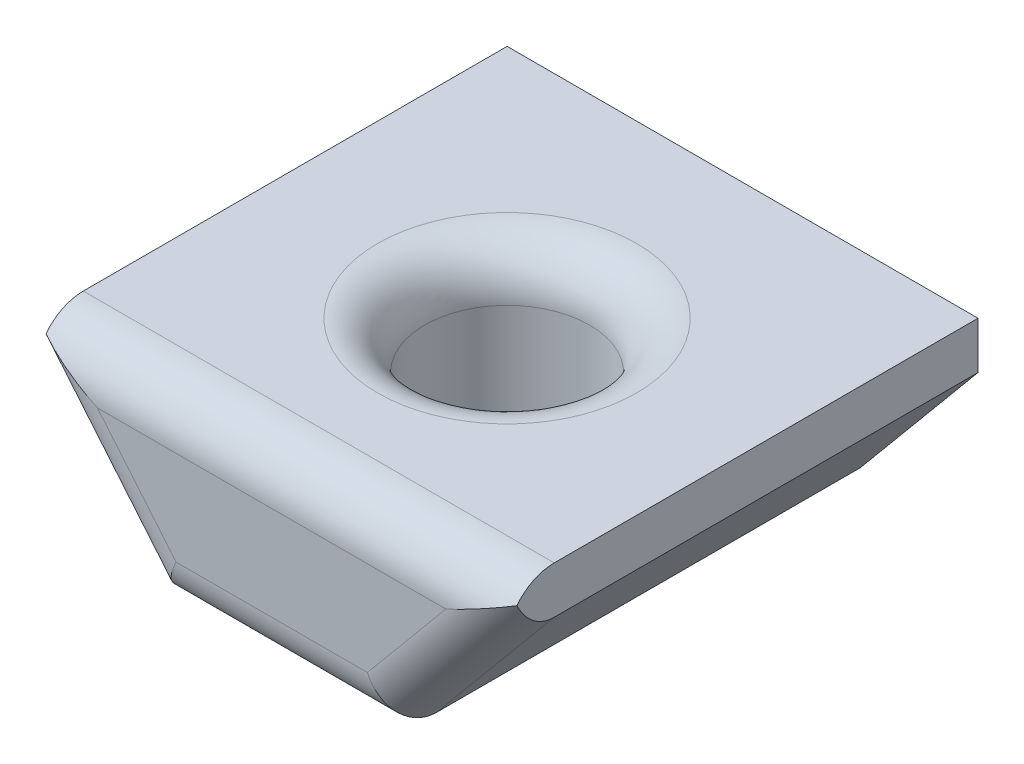
ISO-10303-21;
HEADER;
FILE_DESCRIPTION(('STEP AP214'),'2;1');
FILE_NAME('part.step','',(''),(''),'','','');
FILE_SCHEMA(('AUTOMOTIVE_DESIGN { 1 0 10303 214 1 1 1 1 }'));
ENDSEC;
DATA;
#1=APPLICATION_CONTEXT('core data for automotive mechanical design processes');
#2=APPLICATION_PROTOCOL_DEFINITION('international standard','automotive_design',2000,#1);
#3=PRODUCT_CONTEXT('',#1,'mechanical');
#4=PRODUCT('Part','Part','',(#3));
#5=PRODUCT_RELATED_PRODUCT_CATEGORY('part','',(#4));
#6=PRODUCT_DEFINITION_FORMATION('','',#4);
#7=PRODUCT_DEFINITION_CONTEXT('part definition',#1,'design');
#8=PRODUCT_DEFINITION('design','',#6,#7);
#9=PRODUCT_DEFINITION_SHAPE('','',#8);
#10=(LENGTH_UNIT() NAMED_UNIT(*) SI_UNIT(.MILLI.,.METRE.));
#11=(NAMED_UNIT(*) PLANE_ANGLE_UNIT() SI_UNIT($,.RADIAN.));
#12=(NAMED_UNIT(*) SI_UNIT($,.STERADIAN.) SOLID_ANGLE_UNIT());
#13=UNCERTAINTY_MEASURE_WITH_UNIT(LENGTH_MEASURE(1.E-05),#10,'distance_accuracy_value','');
#14=(GEOMETRIC_REPRESENTATION_CONTEXT(3) GLOBAL_UNCERTAINTY_ASSIGNED_CONTEXT((#13)) GLOBAL_UNIT_ASSIGNED_CONTEXT((#10,
#11,#12)) REPRESENTATION_CONTEXT('',''));
#15=CARTESIAN_POINT('',(0.,0.,0.));
#16=DIRECTION('',(0.,0.,1.));
#17=DIRECTION('',(1.,0.,0.));
#18=AXIS2_PLACEMENT_3D('',#15,#16,#17);
#19=CARTESIAN_POINT('',(2.5,0.,10.));
#20=DIRECTION('',(-0.768221279597376,0.64018439966448,0.));
#21=DIRECTION('',(-0.64018439966448,-0.768221279597376,0.));
#22=AXIS2_PLACEMENT_3D('',#19,#20,#21);
#23=PLANE('',#22);
#24=DIRECTION('',(0.,0.,-1.));
#25=VECTOR('',#24,1.);
#26=CARTESIAN_POINT('',(5.,3.,10.));
#27=LINE('',#26,#25);
#28=CARTESIAN_POINT('',(5.,3.,9.));
#29=VERTEX_POINT('',#28);
#30=CARTESIAN_POINT('',(5.,3.,0.));
#31=VERTEX_POINT('',#30);
#32=EDGE_CURVE('E112',#29,#31,#27,.T.);
#33=ORIENTED_EDGE('',*,*,#32,.F.);
#34=DIRECTION('',(0.64018439966448,0.768221279597376,0.));
#35=VECTOR('',#34,1.);
#36=CARTESIAN_POINT('',(2.5,0.,9.));
#37=LINE('',#36,#35);
#38=CARTESIAN_POINT('',(2.5,0.,9.));
#39=VERTEX_POINT('',#38);
#40=EDGE_CURVE('E194',#29,#39,#37,.F.);
#41=ORIENTED_EDGE('',*,*,#40,.T.);
#42=DIRECTION('',(0.,0.,-1.));
#43=VECTOR('',#42,1.);
#44=CARTESIAN_POINT('',(2.5,0.,10.));
#45=LINE('',#44,#43);
#46=CARTESIAN_POINT('',(2.5,0.,0.));
#47=VERTEX_POINT('',#46);
#48=EDGE_CURVE('E138',#39,#47,#45,.T.);
#49=ORIENTED_EDGE('',*,*,#48,.T.);
#50=DIRECTION('',(0.64018439966448,0.768221279597376,0.));
#51=VECTOR('',#50,1.);
#52=CARTESIAN_POINT('',(2.5,0.,0.));
#53=LINE('',#52,#51);
#54=EDGE_CURVE('E131',#47,#31,#53,.T.);
#55=ORIENTED_EDGE('',*,*,#54,.T.);
#56=EDGE_LOOP('',(#33,#41,#49,#55));
#57=FACE_BOUND('',#56,.T.);
#58=ADVANCED_FACE('F39',(#57),#23,.F.);
#59=CARTESIAN_POINT('',(5.,3.,10.));
#60=DIRECTION('',(-1.,0.,0.));
#61=DIRECTION('',(0.,-1.,0.));
#62=AXIS2_PLACEMENT_3D('',#59,#60,#61);
#63=PLANE('',#62);
#64=CARTESIAN_POINT('',(5.,3.,9.));
#65=DIRECTION('',(-1.,0.,0.));
#66=DIRECTION('',(0.,-1.,0.));
#67=AXIS2_PLACEMENT_3D('',#64,#65,#66);
#68=CIRCLE('',#67,1.);
#69=CARTESIAN_POINT('',(5.,4.,9.));
#70=VERTEX_POINT('',#69);
#71=CARTESIAN_POINT('',(5.,3.60968754501296,9.79264184689938));
#72=VERTEX_POINT('',#71);
#73=EDGE_CURVE('E189',#70,#72,#68,.F.);
#74=ORIENTED_EDGE('',*,*,#73,.T.);
#75=CARTESIAN_POINT('',(5.,4.56204993518133,9.));
#76=DIRECTION('',(-1.,0.,0.));
#77=DIRECTION('',(0.,-1.,0.));
#78=AXIS2_PLACEMENT_3D('',#75,#76,#77);
#79=ELLIPSE('',#78,1.56204993518133,1.);
#80=EDGE_CURVE('E119',#72,#29,#79,.F.);
#81=ORIENTED_EDGE('',*,*,#80,.T.);
#82=ORIENTED_EDGE('',*,*,#32,.T.);
#83=DIRECTION('',(0.,1.,0.));
#84=VECTOR('',#83,1.);
#85=CARTESIAN_POINT('',(5.,3.,0.));
#86=LINE('',#85,#84);
#87=CARTESIAN_POINT('',(5.,4.,0.));
#88=VERTEX_POINT('',#87);
#89=EDGE_CURVE('E116',#31,#88,#86,.T.);
#90=ORIENTED_EDGE('',*,*,#89,.T.);
#91=DIRECTION('',(0.,0.,-1.));
#92=VECTOR('',#91,1.);
#93=CARTESIAN_POINT('',(5.,4.,10.));
#94=LINE('',#93,#92);
#95=EDGE_CURVE('E125',#70,#88,#94,.T.);
#96=ORIENTED_EDGE('',*,*,#95,.F.);
#97=EDGE_LOOP('',(#74,#81,#82,#90,#96));
#98=FACE_BOUND('',#97,.T.);
#99=ADVANCED_FACE('F114',(#98),#63,.F.);
#100=CARTESIAN_POINT('',(5.,4.,10.));
#101=DIRECTION('',(0.,-1.,0.));
#102=DIRECTION('',(0.,0.,-1.));
#103=AXIS2_PLACEMENT_3D('',#100,#101,#102);
#104=PLANE('',#103);
#105=CARTESIAN_POINT('',(0.,4.,5.));
#106=DIRECTION('',(0.,-1.,0.));
#107=DIRECTION('',(0.,0.,-1.));
#108=AXIS2_PLACEMENT_3D('',#105,#106,#107);
#109=CIRCLE('',#108,2.75);
#110=CARTESIAN_POINT('',(0.,4.,2.25));
#111=VERTEX_POINT('',#110);
#112=EDGE_CURVE('E204',#111,#111,#109,.T.);
#113=ORIENTED_EDGE('',*,*,#112,.T.);
#114=EDGE_LOOP('',(#113));
#115=FACE_BOUND('',#114,.T.);
#116=DIRECTION('',(0.,0.,-1.));
#117=VECTOR('',#116,1.);
#118=CARTESIAN_POINT('',(-5.,4.,10.));
#119=LINE('',#118,#117);
#120=CARTESIAN_POINT('',(-5.,4.,9.));
#121=VERTEX_POINT('',#120);
#122=CARTESIAN_POINT('',(-5.,4.,0.));
#123=VERTEX_POINT('',#122);
#124=EDGE_CURVE('E168',#121,#123,#119,.T.);
#125=ORIENTED_EDGE('',*,*,#124,.F.);
#126=DIRECTION('',(-1.,0.,0.));
#127=VECTOR('',#126,1.);
#128=CARTESIAN_POINT('',(5.,4.,9.));
#129=LINE('',#128,#127);
#130=EDGE_CURVE('E49',#121,#70,#129,.F.);
#131=ORIENTED_EDGE('',*,*,#130,.T.);
#132=ORIENTED_EDGE('',*,*,#95,.T.);
#133=DIRECTION('',(-1.,0.,0.));
#134=VECTOR('',#133,1.);
#135=CARTESIAN_POINT('',(5.,4.,0.));
#136=LINE('',#135,#134);
#137=EDGE_CURVE('E134',#88,#123,#136,.T.);
#138=ORIENTED_EDGE('',*,*,#137,.T.);
#139=EDGE_LOOP('',(#125,#131,#132,#138));
#140=FACE_BOUND('',#139,.T.);
#141=ADVANCED_FACE('F235',(#115,#140),#104,.F.);
#142=CARTESIAN_POINT('',(-5.,3.,10.));
#143=DIRECTION('',(1.,0.,0.));
#144=DIRECTION('',(0.,1.,0.));
#145=AXIS2_PLACEMENT_3D('',#142,#143,#144);
#146=PLANE('',#145);
#147=DIRECTION('',(0.,0.,-1.));
#148=VECTOR('',#147,1.);
#149=CARTESIAN_POINT('',(-5.,3.,10.));
#150=LINE('',#149,#148);
#151=CARTESIAN_POINT('',(-5.,3.,9.));
#152=VERTEX_POINT('',#151);
#153=CARTESIAN_POINT('',(-5.,3.,0.));
#154=VERTEX_POINT('',#153);
#155=EDGE_CURVE('E165',#152,#154,#150,.T.);
#156=ORIENTED_EDGE('',*,*,#155,.F.);
#157=CARTESIAN_POINT('',(-5.,4.56204993518133,9.));
#158=DIRECTION('',(1.,0.,0.));
#159=DIRECTION('',(0.,1.,0.));
#160=AXIS2_PLACEMENT_3D('',#157,#158,#159);
#161=ELLIPSE('',#160,1.56204993518133,1.);
#162=CARTESIAN_POINT('',(-5.,3.60968754501296,9.79264184689938));
#163=VERTEX_POINT('',#162);
#164=EDGE_CURVE('E57',#152,#163,#161,.F.);
#165=ORIENTED_EDGE('',*,*,#164,.T.);
#166=CARTESIAN_POINT('',(-5.,3.,9.));
#167=DIRECTION('',(1.,0.,0.));
#168=DIRECTION('',(0.,1.,0.));
#169=AXIS2_PLACEMENT_3D('',#166,#167,#168);
#170=CIRCLE('',#169,1.);
#171=EDGE_CURVE('E61',#163,#121,#170,.F.);
#172=ORIENTED_EDGE('',*,*,#171,.T.);
#173=ORIENTED_EDGE('',*,*,#124,.T.);
#174=DIRECTION('',(0.,-1.,0.));
#175=VECTOR('',#174,1.);
#176=CARTESIAN_POINT('',(-5.,3.,0.));
#177=LINE('',#176,#175);
#178=EDGE_CURVE('E149',#123,#154,#177,.T.);
#179=ORIENTED_EDGE('',*,*,#178,.T.);
#180=EDGE_LOOP('',(#156,#165,#172,#173,#179));
#181=FACE_BOUND('',#180,.T.);
#182=ADVANCED_FACE('F247',(#181),#146,.F.);
#183=CARTESIAN_POINT('',(-2.5,0.,10.));
#184=DIRECTION('',(0.768221279597376,0.64018439966448,0.));
#185=DIRECTION('',(-0.64018439966448,0.768221279597376,0.));
#186=AXIS2_PLACEMENT_3D('',#183,#184,#185);
#187=PLANE('',#186);
#188=DIRECTION('',(0.,0.,-1.));
#189=VECTOR('',#188,1.);
#190=CARTESIAN_POINT('',(-2.5,0.,10.));
#191=LINE('',#190,#189);
#192=CARTESIAN_POINT('',(-2.5,0.,9.));
#193=VERTEX_POINT('',#192);
#194=CARTESIAN_POINT('',(-2.5,0.,0.));
#195=VERTEX_POINT('',#194);
#196=EDGE_CURVE('E162',#193,#195,#191,.T.);
#197=ORIENTED_EDGE('',*,*,#196,.F.);
#198=DIRECTION('',(0.64018439966448,-0.768221279597376,0.));
#199=VECTOR('',#198,1.);
#200=CARTESIAN_POINT('',(-5.,3.,9.));
#201=LINE('',#200,#199);
#202=EDGE_CURVE('E197',#193,#152,#201,.F.);
#203=ORIENTED_EDGE('',*,*,#202,.T.);
#204=ORIENTED_EDGE('',*,*,#155,.T.);
#205=DIRECTION('',(0.64018439966448,-0.768221279597376,0.));
#206=VECTOR('',#205,1.);
#207=CARTESIAN_POINT('',(-2.5,0.,0.));
#208=LINE('',#207,#206);
#209=EDGE_CURVE('E153',#154,#195,#208,.T.);
#210=ORIENTED_EDGE('',*,*,#209,.T.);
#211=EDGE_LOOP('',(#197,#203,#204,#210));
#212=FACE_BOUND('',#211,.T.);
#213=ADVANCED_FACE('F246',(#212),#187,.F.);
#214=CARTESIAN_POINT('',(-2.5,0.,10.));
#215=DIRECTION('',(0.,1.,0.));
#216=DIRECTION('',(0.,0.,1.));
#217=AXIS2_PLACEMENT_3D('',#214,#215,#216);
#218=PLANE('',#217);
#219=CARTESIAN_POINT('',(0.,0.,5.));
#220=DIRECTION('',(0.,1.,0.));
#221=DIRECTION('',(0.,0.,1.));
#222=AXIS2_PLACEMENT_3D('',#219,#220,#221);
#223=CIRCLE('',#222,1.75);
#224=CARTESIAN_POINT('',(0.,0.,6.75));
#225=VERTEX_POINT('',#224);
#226=EDGE_CURVE('E141',#225,#225,#223,.T.);
#227=ORIENTED_EDGE('',*,*,#226,.T.);
#228=EDGE_LOOP('',(#227));
#229=FACE_BOUND('',#228,.T.);
#230=ORIENTED_EDGE('',*,*,#48,.F.);
#231=DIRECTION('',(1.,0.,0.));
#232=VECTOR('',#231,1.);
#233=CARTESIAN_POINT('',(-2.5,0.,9.));
#234=LINE('',#233,#232);
#235=EDGE_CURVE('E185',#39,#193,#234,.F.);
#236=ORIENTED_EDGE('',*,*,#235,.T.);
#237=ORIENTED_EDGE('',*,*,#196,.T.);
#238=DIRECTION('',(1.,0.,0.));
#239=VECTOR('',#238,1.);
#240=CARTESIAN_POINT('',(-2.5,0.,0.));
#241=LINE('',#240,#239);
#242=EDGE_CURVE('E157',#195,#47,#241,.T.);
#243=ORIENTED_EDGE('',*,*,#242,.T.);
#244=EDGE_LOOP('',(#230,#236,#237,#243));
#245=FACE_BOUND('',#244,.T.);
#246=ADVANCED_FACE('F240',(#229,#245),#218,.F.);
#247=CARTESIAN_POINT('',(0.,0.,10.));
#248=DIRECTION('',(0.,0.,1.));
#249=DIRECTION('',(1.,0.,0.));
#250=AXIS2_PLACEMENT_3D('',#247,#248,#249);
#251=PLANE('',#250);
#252=DIRECTION('',(0.64018439966448,-0.768221279597376,0.));
#253=VECTOR('',#252,1.);
#254=CARTESIAN_POINT('',(-1.73177872040262,0.64018439966448,10.));
#255=LINE('',#254,#253);
#256=CARTESIAN_POINT('',(-3.69829172068223,3.,10.));
#257=VERTEX_POINT('',#256);
#258=CARTESIAN_POINT('',(-2.03162505401556,1.,10.));
#259=VERTEX_POINT('',#258);
#260=EDGE_CURVE('E175',#257,#259,#255,.T.);
#261=ORIENTED_EDGE('',*,*,#260,.T.);
#262=DIRECTION('',(1.,0.,0.));
#263=VECTOR('',#262,1.);
#264=CARTESIAN_POINT('',(2.5,1.,10.));
#265=LINE('',#264,#263);
#266=CARTESIAN_POINT('',(2.03162505401556,1.,10.));
#267=VERTEX_POINT('',#266);
#268=EDGE_CURVE('E181',#259,#267,#265,.T.);
#269=ORIENTED_EDGE('',*,*,#268,.T.);
#270=DIRECTION('',(0.64018439966448,0.768221279597376,0.));
#271=VECTOR('',#270,1.);
#272=CARTESIAN_POINT('',(4.23177872040262,3.64018439966448,10.));
#273=LINE('',#272,#271);
#274=CARTESIAN_POINT('',(3.69829172068222,3.,10.));
#275=VERTEX_POINT('',#274);
#276=EDGE_CURVE('E178',#267,#275,#273,.T.);
#277=ORIENTED_EDGE('',*,*,#276,.T.);
#278=DIRECTION('',(-1.,0.,0.));
#279=VECTOR('',#278,1.);
#280=CARTESIAN_POINT('',(-5.,3.,10.));
#281=LINE('',#280,#279);
#282=EDGE_CURVE('E124',#275,#257,#281,.T.);
#283=ORIENTED_EDGE('',*,*,#282,.T.);
#284=EDGE_LOOP('',(#261,#269,#277,#283));
#285=FACE_BOUND('',#284,.T.);
#286=ADVANCED_FACE('F280',(#285),#251,.T.);
#287=CARTESIAN_POINT('',(0.,0.,0.));
#288=DIRECTION('',(0.,0.,1.));
#289=DIRECTION('',(1.,0.,0.));
#290=AXIS2_PLACEMENT_3D('',#287,#288,#289);
#291=PLANE('',#290);
#292=ORIENTED_EDGE('',*,*,#54,.F.);
#293=ORIENTED_EDGE('',*,*,#242,.F.);
#294=ORIENTED_EDGE('',*,*,#209,.F.);
#295=ORIENTED_EDGE('',*,*,#178,.F.);
#296=ORIENTED_EDGE('',*,*,#137,.F.);
#297=ORIENTED_EDGE('',*,*,#89,.F.);
#298=EDGE_LOOP('',(#292,#293,#294,#295,#296,#297));
#299=FACE_BOUND('',#298,.T.);
#300=ADVANCED_FACE('F129',(#299),#291,.F.);
#301=CARTESIAN_POINT('',(0.,0.,5.));
#302=DIRECTION('',(0.,1.,0.));
#303=DIRECTION('',(0.,0.,1.));
#304=AXIS2_PLACEMENT_3D('',#301,#302,#303);
#305=CYLINDRICAL_SURFACE('',#304,1.75);
#306=CARTESIAN_POINT('',(0.,3.,5.));
#307=DIRECTION('',(0.,-1.,0.));
#308=DIRECTION('',(0.,0.,-1.));
#309=AXIS2_PLACEMENT_3D('',#306,#307,#308);
#310=CIRCLE('',#309,1.75);
#311=CARTESIAN_POINT('',(0.,3.,3.25));
#312=VERTEX_POINT('',#311);
#313=EDGE_CURVE('E11',#312,#312,#310,.F.);
#314=ORIENTED_EDGE('',*,*,#313,.T.);
#315=EDGE_LOOP('',(#314));
#316=FACE_BOUND('',#315,.T.);
#317=ORIENTED_EDGE('',*,*,#226,.F.);
#318=EDGE_LOOP('',(#317));
#319=FACE_BOUND('',#318,.T.);
#320=ADVANCED_FACE('F271',(#316,#319),#305,.F.);
#321=CARTESIAN_POINT('',(0.,3.,9.));
#322=DIRECTION('',(1.,0.,0.));
#323=DIRECTION('',(0.,0.,-1.));
#324=AXIS2_PLACEMENT_3D('',#321,#322,#323);
#325=CYLINDRICAL_SURFACE('',#324,1.);
#326=ORIENTED_EDGE('',*,*,#130,.F.);
#327=ORIENTED_EDGE('',*,*,#171,.F.);
#328=CARTESIAN_POINT('',(-3.69829172068222,3.,9.));
#329=DIRECTION('',(0.424155396249724,0.90558942122368,0.));
#330=DIRECTION('',(-0.90558942122368,0.424155396249724,0.));
#331=AXIS2_PLACEMENT_3D('',#328,#329,#330);
#332=ELLIPSE('',#331,2.35762649453891,1.);
#333=EDGE_CURVE('E43',#257,#163,#332,.F.);
#334=ORIENTED_EDGE('',*,*,#333,.F.);
#335=ORIENTED_EDGE('',*,*,#282,.F.);
#336=CARTESIAN_POINT('',(3.69829172068222,3.,9.));
#337=DIRECTION('',(0.424155396249724,-0.90558942122368,0.));
#338=DIRECTION('',(0.90558942122368,0.424155396249724,0.));
#339=AXIS2_PLACEMENT_3D('',#336,#337,#338);
#340=ELLIPSE('',#339,2.35762649453891,1.);
#341=EDGE_CURVE('E215',#72,#275,#340,.T.);
#342=ORIENTED_EDGE('',*,*,#341,.F.);
#343=ORIENTED_EDGE('',*,*,#73,.F.);
#344=EDGE_LOOP('',(#326,#327,#334,#335,#342,#343));
#345=FACE_BOUND('',#344,.T.);
#346=ADVANCED_FACE('F232',(#345),#325,.T.);
#347=CARTESIAN_POINT('',(-0.707188556468198,-0.589323797056832,9.));
#348=DIRECTION('',(-0.64018439966448,0.768221279597376,0.));
#349=DIRECTION('',(-0.768221279597376,-0.64018439966448,0.));
#350=AXIS2_PLACEMENT_3D('',#347,#348,#349);
#351=CYLINDRICAL_SURFACE('',#350,1.);
#352=ORIENTED_EDGE('',*,*,#164,.F.);
#353=ORIENTED_EDGE('',*,*,#202,.F.);
#354=CARTESIAN_POINT('',(-2.03162505401556,1.,9.));
#355=DIRECTION('',(-0.90558942122368,0.424155396249724,0.));
#356=DIRECTION('',(0.424155396249724,0.90558942122368,0.));
#357=AXIS2_PLACEMENT_3D('',#354,#355,#356);
#358=ELLIPSE('',#357,1.10425318203115,1.);
#359=EDGE_CURVE('E213',#259,#193,#358,.F.);
#360=ORIENTED_EDGE('',*,*,#359,.F.);
#361=ORIENTED_EDGE('',*,*,#260,.F.);
#362=ORIENTED_EDGE('',*,*,#333,.T.);
#363=EDGE_LOOP('',(#352,#353,#360,#361,#362));
#364=FACE_BOUND('',#363,.T.);
#365=ADVANCED_FACE('F226',(#364),#351,.T.);
#366=CARTESIAN_POINT('',(0.707188556468198,-0.589323797056832,9.));
#367=DIRECTION('',(-0.64018439966448,-0.768221279597376,0.));
#368=DIRECTION('',(0.768221279597376,-0.64018439966448,0.));
#369=AXIS2_PLACEMENT_3D('',#366,#367,#368);
#370=CYLINDRICAL_SURFACE('',#369,1.);
#371=ORIENTED_EDGE('',*,*,#341,.T.);
#372=ORIENTED_EDGE('',*,*,#276,.F.);
#373=CARTESIAN_POINT('',(2.03162505401556,1.,9.));
#374=DIRECTION('',(-0.90558942122368,-0.424155396249724,0.));
#375=DIRECTION('',(0.424155396249724,-0.90558942122368,0.));
#376=AXIS2_PLACEMENT_3D('',#373,#374,#375);
#377=ELLIPSE('',#376,1.10425318203115,1.);
#378=EDGE_CURVE('E210',#39,#267,#377,.T.);
#379=ORIENTED_EDGE('',*,*,#378,.F.);
#380=ORIENTED_EDGE('',*,*,#40,.F.);
#381=ORIENTED_EDGE('',*,*,#80,.F.);
#382=EDGE_LOOP('',(#371,#372,#379,#380,#381));
#383=FACE_BOUND('',#382,.T.);
#384=ADVANCED_FACE('F236',(#383),#370,.T.);
#385=CARTESIAN_POINT('',(0.,1.,9.));
#386=DIRECTION('',(-1.,0.,0.));
#387=DIRECTION('',(0.,0.,1.));
#388=AXIS2_PLACEMENT_3D('',#385,#386,#387);
#389=CYLINDRICAL_SURFACE('',#388,1.);
#390=ORIENTED_EDGE('',*,*,#359,.T.);
#391=ORIENTED_EDGE('',*,*,#235,.F.);
#392=ORIENTED_EDGE('',*,*,#378,.T.);
#393=ORIENTED_EDGE('',*,*,#268,.F.);
#394=EDGE_LOOP('',(#390,#391,#392,#393));
#395=FACE_BOUND('',#394,.T.);
#396=ADVANCED_FACE('F243',(#395),#389,.T.);
#397=CARTESIAN_POINT('',(0.,3.,5.));
#398=DIRECTION('',(0.,-1.,0.));
#399=DIRECTION('',(0.,0.,-1.));
#400=AXIS2_PLACEMENT_3D('',#397,#398,#399);
#401=TOROIDAL_SURFACE('',#400,2.75,1.);
#402=ORIENTED_EDGE('',*,*,#112,.F.);
#403=EDGE_LOOP('',(#402));
#404=FACE_BOUND('',#403,.T.);
#405=ORIENTED_EDGE('',*,*,#313,.F.);
#406=EDGE_LOOP('',(#405));
#407=FACE_BOUND('',#406,.T.);
#408=ADVANCED_FACE('F41',(#404,#407),#401,.T.);
#409=CLOSED_SHELL('',(#58,#99,#141,#182,#213,#246,#286,#300,#320,#346,#365,#384,#396,#408));
#410=MANIFOLD_SOLID_BREP('B2',#409);
#411=ADVANCED_BREP_SHAPE_REPRESENTATION('',(#18,#410),#14);
#412=SHAPE_DEFINITION_REPRESENTATION(#9,#411);
ENDSEC;
END-ISO-10303-21;
